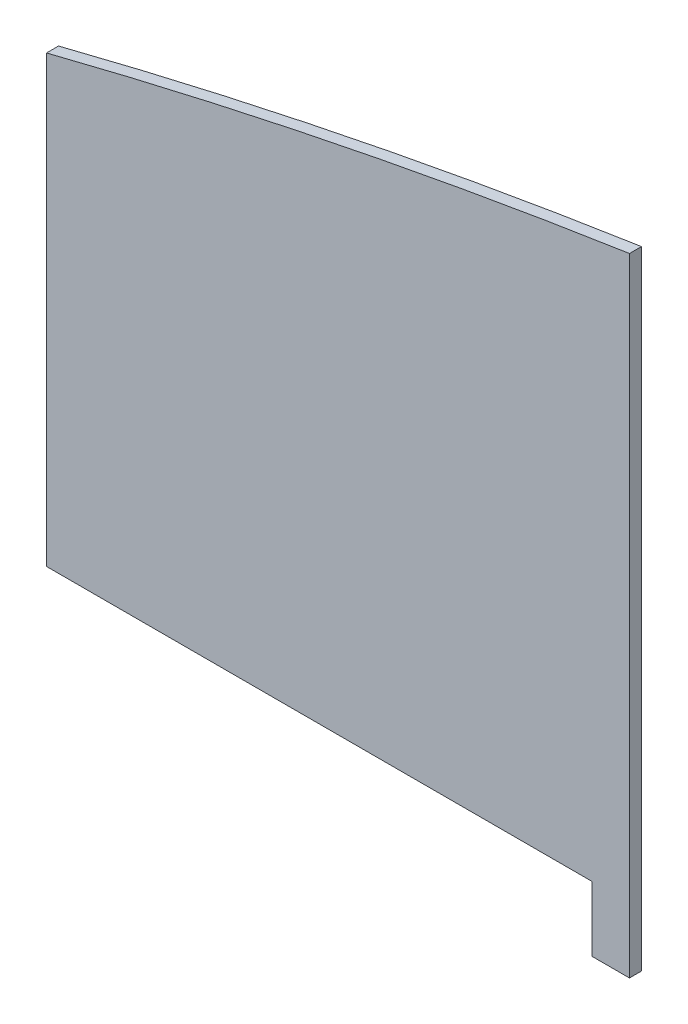
ISO-10303-21;
HEADER;
FILE_DESCRIPTION(('STEP AP214'),'2;1');
FILE_NAME('part.step','',(''),(''),'','','');
FILE_SCHEMA(('AUTOMOTIVE_DESIGN { 1 0 10303 214 1 1 1 1 }'));
ENDSEC;
DATA;
#1=APPLICATION_CONTEXT('core data for automotive mechanical design processes');
#2=APPLICATION_PROTOCOL_DEFINITION('international standard','automotive_design',2000,#1);
#3=PRODUCT_CONTEXT('',#1,'mechanical');
#4=PRODUCT('Part','Part','',(#3));
#5=PRODUCT_RELATED_PRODUCT_CATEGORY('part','',(#4));
#6=PRODUCT_DEFINITION_FORMATION('','',#4);
#7=PRODUCT_DEFINITION_CONTEXT('part definition',#1,'design');
#8=PRODUCT_DEFINITION('design','',#6,#7);
#9=PRODUCT_DEFINITION_SHAPE('','',#8);
#10=(LENGTH_UNIT() NAMED_UNIT(*) SI_UNIT(.MILLI.,.METRE.));
#11=(NAMED_UNIT(*) PLANE_ANGLE_UNIT() SI_UNIT($,.RADIAN.));
#12=(NAMED_UNIT(*) SI_UNIT($,.STERADIAN.) SOLID_ANGLE_UNIT());
#13=UNCERTAINTY_MEASURE_WITH_UNIT(LENGTH_MEASURE(1.E-05),#10,'distance_accuracy_value','');
#14=(GEOMETRIC_REPRESENTATION_CONTEXT(3) GLOBAL_UNCERTAINTY_ASSIGNED_CONTEXT((#13)) GLOBAL_UNIT_ASSIGNED_CONTEXT((#10,
#11,#12)) REPRESENTATION_CONTEXT('',''));
#15=CARTESIAN_POINT('',(0.,0.,0.));
#16=DIRECTION('',(0.,0.,1.));
#17=DIRECTION('',(1.,0.,0.));
#18=AXIS2_PLACEMENT_3D('',#15,#16,#17);
#19=CARTESIAN_POINT('',(454.,0.,-10.));
#20=DIRECTION('',(0.,-1.,0.));
#21=DIRECTION('',(1.,0.,0.));
#22=AXIS2_PLACEMENT_3D('',#19,#20,#21);
#23=PLANE('',#22);
#24=DIRECTION('',(1.,0.,0.));
#25=VECTOR('',#24,1.);
#26=CARTESIAN_POINT('',(454.,0.,0.));
#27=LINE('',#26,#25);
#28=CARTESIAN_POINT('',(0.,0.,0.));
#29=VERTEX_POINT('',#28);
#30=CARTESIAN_POINT('',(454.,0.,0.));
#31=VERTEX_POINT('',#30);
#32=EDGE_CURVE('E125',#29,#31,#27,.T.);
#33=ORIENTED_EDGE('',*,*,#32,.F.);
#34=DIRECTION('',(0.,0.,1.));
#35=VECTOR('',#34,1.);
#36=CARTESIAN_POINT('',(0.,0.,-10.));
#37=LINE('',#36,#35);
#38=CARTESIAN_POINT('',(0.,0.,-10.));
#39=VERTEX_POINT('',#38);
#40=EDGE_CURVE('E11',#39,#29,#37,.T.);
#41=ORIENTED_EDGE('',*,*,#40,.F.);
#42=DIRECTION('',(1.,0.,0.));
#43=VECTOR('',#42,1.);
#44=CARTESIAN_POINT('',(454.,0.,-10.));
#45=LINE('',#44,#43);
#46=CARTESIAN_POINT('',(454.,0.,-10.));
#47=VERTEX_POINT('',#46);
#48=EDGE_CURVE('E139',#39,#47,#45,.T.);
#49=ORIENTED_EDGE('',*,*,#48,.T.);
#50=DIRECTION('',(0.,0.,1.));
#51=VECTOR('',#50,1.);
#52=CARTESIAN_POINT('',(454.,0.,-10.));
#53=LINE('',#52,#51);
#54=EDGE_CURVE('E43',#47,#31,#53,.T.);
#55=ORIENTED_EDGE('',*,*,#54,.T.);
#56=EDGE_LOOP('',(#33,#41,#49,#55));
#57=FACE_BOUND('',#56,.T.);
#58=ADVANCED_FACE('F40',(#57),#23,.T.);
#59=CARTESIAN_POINT('',(0.,0.,-10.));
#60=DIRECTION('',(-1.,0.,0.));
#61=DIRECTION('',(0.,0.,1.));
#62=AXIS2_PLACEMENT_3D('',#59,#60,#61);
#63=PLANE('',#62);
#64=DIRECTION('',(0.,-1.,0.));
#65=VECTOR('',#64,1.);
#66=CARTESIAN_POINT('',(0.,0.,0.));
#67=LINE('',#66,#65);
#68=CARTESIAN_POINT('',(0.,370.,0.));
#69=VERTEX_POINT('',#68);
#70=EDGE_CURVE('E137',#69,#29,#67,.T.);
#71=ORIENTED_EDGE('',*,*,#70,.F.);
#72=DIRECTION('',(0.,0.,1.));
#73=VECTOR('',#72,1.);
#74=CARTESIAN_POINT('',(0.,370.,-10.));
#75=LINE('',#74,#73);
#76=CARTESIAN_POINT('',(0.,370.,-10.));
#77=VERTEX_POINT('',#76);
#78=EDGE_CURVE('E49',#77,#69,#75,.T.);
#79=ORIENTED_EDGE('',*,*,#78,.F.);
#80=DIRECTION('',(0.,-1.,0.));
#81=VECTOR('',#80,1.);
#82=CARTESIAN_POINT('',(0.,0.,-10.));
#83=LINE('',#82,#81);
#84=EDGE_CURVE('E115',#77,#39,#83,.T.);
#85=ORIENTED_EDGE('',*,*,#84,.T.);
#86=ORIENTED_EDGE('',*,*,#40,.T.);
#87=EDGE_LOOP('',(#71,#79,#85,#86));
#88=FACE_BOUND('',#87,.T.);
#89=ADVANCED_FACE('F147',(#88),#63,.T.);
#90=CARTESIAN_POINT('',(1226.13826647228,-4449.00570652098,-10.));
#91=DIRECTION('',(0.,0.,1.));
#92=DIRECTION('',(1.,0.,0.));
#93=AXIS2_PLACEMENT_3D('',#90,#91,#92);
#94=CYLINDRICAL_SURFACE('',#93,4972.54774215285);
#95=CARTESIAN_POINT('',(1226.13826647228,-4449.00570652098,0.));
#96=DIRECTION('',(0.,0.,1.));
#97=DIRECTION('',(-1.,0.,0.));
#98=AXIS2_PLACEMENT_3D('',#95,#96,#97);
#99=CIRCLE('',#98,4972.54774215285);
#100=CARTESIAN_POINT('',(485.,468.000000000001,0.));
#101=VERTEX_POINT('',#100);
#102=EDGE_CURVE('E102',#101,#69,#99,.T.);
#103=ORIENTED_EDGE('',*,*,#102,.F.);
#104=DIRECTION('',(0.,0.,1.));
#105=VECTOR('',#104,1.);
#106=CARTESIAN_POINT('',(485.,468.000000000001,-10.));
#107=LINE('',#106,#105);
#108=CARTESIAN_POINT('',(485.,468.000000000001,-10.));
#109=VERTEX_POINT('',#108);
#110=EDGE_CURVE('E97',#109,#101,#107,.T.);
#111=ORIENTED_EDGE('',*,*,#110,.F.);
#112=CARTESIAN_POINT('',(1226.13826647228,-4449.00570652098,-10.));
#113=DIRECTION('',(0.,0.,1.));
#114=DIRECTION('',(-1.,0.,0.));
#115=AXIS2_PLACEMENT_3D('',#112,#113,#114);
#116=CIRCLE('',#115,4972.54774215285);
#117=EDGE_CURVE('E100',#109,#77,#116,.T.);
#118=ORIENTED_EDGE('',*,*,#117,.T.);
#119=ORIENTED_EDGE('',*,*,#78,.T.);
#120=EDGE_LOOP('',(#103,#111,#118,#119));
#121=FACE_BOUND('',#120,.T.);
#122=ADVANCED_FACE('F99',(#121),#94,.T.);
#123=CARTESIAN_POINT('',(485.,468.,-10.));
#124=DIRECTION('',(1.,0.,0.));
#125=DIRECTION('',(0.,1.,0.));
#126=AXIS2_PLACEMENT_3D('',#123,#124,#125);
#127=PLANE('',#126);
#128=DIRECTION('',(0.,1.,0.));
#129=VECTOR('',#128,1.);
#130=CARTESIAN_POINT('',(485.,468.,0.));
#131=LINE('',#130,#129);
#132=CARTESIAN_POINT('',(485.,-54.,0.));
#133=VERTEX_POINT('',#132);
#134=EDGE_CURVE('E134',#133,#101,#131,.T.);
#135=ORIENTED_EDGE('',*,*,#134,.F.);
#136=DIRECTION('',(0.,0.,1.));
#137=VECTOR('',#136,1.);
#138=CARTESIAN_POINT('',(485.,-54.,-10.));
#139=LINE('',#138,#137);
#140=CARTESIAN_POINT('',(485.,-54.,-10.));
#141=VERTEX_POINT('',#140);
#142=EDGE_CURVE('E107',#141,#133,#139,.T.);
#143=ORIENTED_EDGE('',*,*,#142,.F.);
#144=DIRECTION('',(0.,1.,0.));
#145=VECTOR('',#144,1.);
#146=CARTESIAN_POINT('',(485.,468.,-10.));
#147=LINE('',#146,#145);
#148=EDGE_CURVE('E113',#141,#109,#147,.T.);
#149=ORIENTED_EDGE('',*,*,#148,.T.);
#150=ORIENTED_EDGE('',*,*,#110,.T.);
#151=EDGE_LOOP('',(#135,#143,#149,#150));
#152=FACE_BOUND('',#151,.T.);
#153=ADVANCED_FACE('F117',(#152),#127,.T.);
#154=CARTESIAN_POINT('',(485.,-54.,-10.));
#155=DIRECTION('',(0.,-1.,0.));
#156=DIRECTION('',(1.,0.,0.));
#157=AXIS2_PLACEMENT_3D('',#154,#155,#156);
#158=PLANE('',#157);
#159=DIRECTION('',(1.,0.,0.));
#160=VECTOR('',#159,1.);
#161=CARTESIAN_POINT('',(485.,-54.,0.));
#162=LINE('',#161,#160);
#163=CARTESIAN_POINT('',(454.,-53.9999999999999,0.));
#164=VERTEX_POINT('',#163);
#165=EDGE_CURVE('E131',#164,#133,#162,.T.);
#166=ORIENTED_EDGE('',*,*,#165,.F.);
#167=DIRECTION('',(0.,0.,1.));
#168=VECTOR('',#167,1.);
#169=CARTESIAN_POINT('',(454.,-53.9999999999999,-10.));
#170=LINE('',#169,#168);
#171=CARTESIAN_POINT('',(454.,-53.9999999999999,-10.));
#172=VERTEX_POINT('',#171);
#173=EDGE_CURVE('E142',#172,#164,#170,.T.);
#174=ORIENTED_EDGE('',*,*,#173,.F.);
#175=DIRECTION('',(1.,0.,0.));
#176=VECTOR('',#175,1.);
#177=CARTESIAN_POINT('',(485.,-54.,-10.));
#178=LINE('',#177,#176);
#179=EDGE_CURVE('E118',#172,#141,#178,.T.);
#180=ORIENTED_EDGE('',*,*,#179,.T.);
#181=ORIENTED_EDGE('',*,*,#142,.T.);
#182=EDGE_LOOP('',(#166,#174,#180,#181));
#183=FACE_BOUND('',#182,.T.);
#184=ADVANCED_FACE('F160',(#183),#158,.T.);
#185=CARTESIAN_POINT('',(454.,-53.9999999999999,-10.));
#186=DIRECTION('',(-1.,0.,0.));
#187=DIRECTION('',(0.,0.,1.));
#188=AXIS2_PLACEMENT_3D('',#185,#186,#187);
#189=PLANE('',#188);
#190=DIRECTION('',(0.,-1.,0.));
#191=VECTOR('',#190,1.);
#192=CARTESIAN_POINT('',(454.,-53.9999999999999,0.));
#193=LINE('',#192,#191);
#194=EDGE_CURVE('E128',#31,#164,#193,.T.);
#195=ORIENTED_EDGE('',*,*,#194,.F.);
#196=ORIENTED_EDGE('',*,*,#54,.F.);
#197=DIRECTION('',(0.,-1.,0.));
#198=VECTOR('',#197,1.);
#199=CARTESIAN_POINT('',(454.,-53.9999999999999,-10.));
#200=LINE('',#199,#198);
#201=EDGE_CURVE('E120',#47,#172,#200,.T.);
#202=ORIENTED_EDGE('',*,*,#201,.T.);
#203=ORIENTED_EDGE('',*,*,#173,.T.);
#204=EDGE_LOOP('',(#195,#196,#202,#203));
#205=FACE_BOUND('',#204,.T.);
#206=ADVANCED_FACE('F144',(#205),#189,.T.);
#207=CARTESIAN_POINT('',(1226.13826647228,-4449.00570652098,-10.));
#208=DIRECTION('',(0.,0.,-1.));
#209=DIRECTION('',(-1.,0.,0.));
#210=AXIS2_PLACEMENT_3D('',#207,#208,#209);
#211=PLANE('',#210);
#212=ORIENTED_EDGE('',*,*,#48,.F.);
#213=ORIENTED_EDGE('',*,*,#84,.F.);
#214=ORIENTED_EDGE('',*,*,#117,.F.);
#215=ORIENTED_EDGE('',*,*,#148,.F.);
#216=ORIENTED_EDGE('',*,*,#179,.F.);
#217=ORIENTED_EDGE('',*,*,#201,.F.);
#218=EDGE_LOOP('',(#212,#213,#214,#215,#216,#217));
#219=FACE_BOUND('',#218,.T.);
#220=ADVANCED_FACE('F111',(#219),#211,.T.);
#221=CARTESIAN_POINT('',(1226.13826647228,-4449.00570652098,0.));
#222=DIRECTION('',(0.,0.,-1.));
#223=DIRECTION('',(-1.,0.,0.));
#224=AXIS2_PLACEMENT_3D('',#221,#222,#223);
#225=PLANE('',#224);
#226=ORIENTED_EDGE('',*,*,#32,.T.);
#227=ORIENTED_EDGE('',*,*,#194,.T.);
#228=ORIENTED_EDGE('',*,*,#165,.T.);
#229=ORIENTED_EDGE('',*,*,#134,.T.);
#230=ORIENTED_EDGE('',*,*,#102,.T.);
#231=ORIENTED_EDGE('',*,*,#70,.T.);
#232=EDGE_LOOP('',(#226,#227,#228,#229,#230,#231));
#233=FACE_BOUND('',#232,.T.);
#234=ADVANCED_FACE('F146',(#233),#225,.F.);
#235=CLOSED_SHELL('',(#58,#89,#122,#153,#184,#206,#220,#234));
#236=MANIFOLD_SOLID_BREP('B2',#235);
#237=ADVANCED_BREP_SHAPE_REPRESENTATION('',(#18,#236),#14);
#238=SHAPE_DEFINITION_REPRESENTATION(#9,#237);
ENDSEC;
END-ISO-10303-21;
